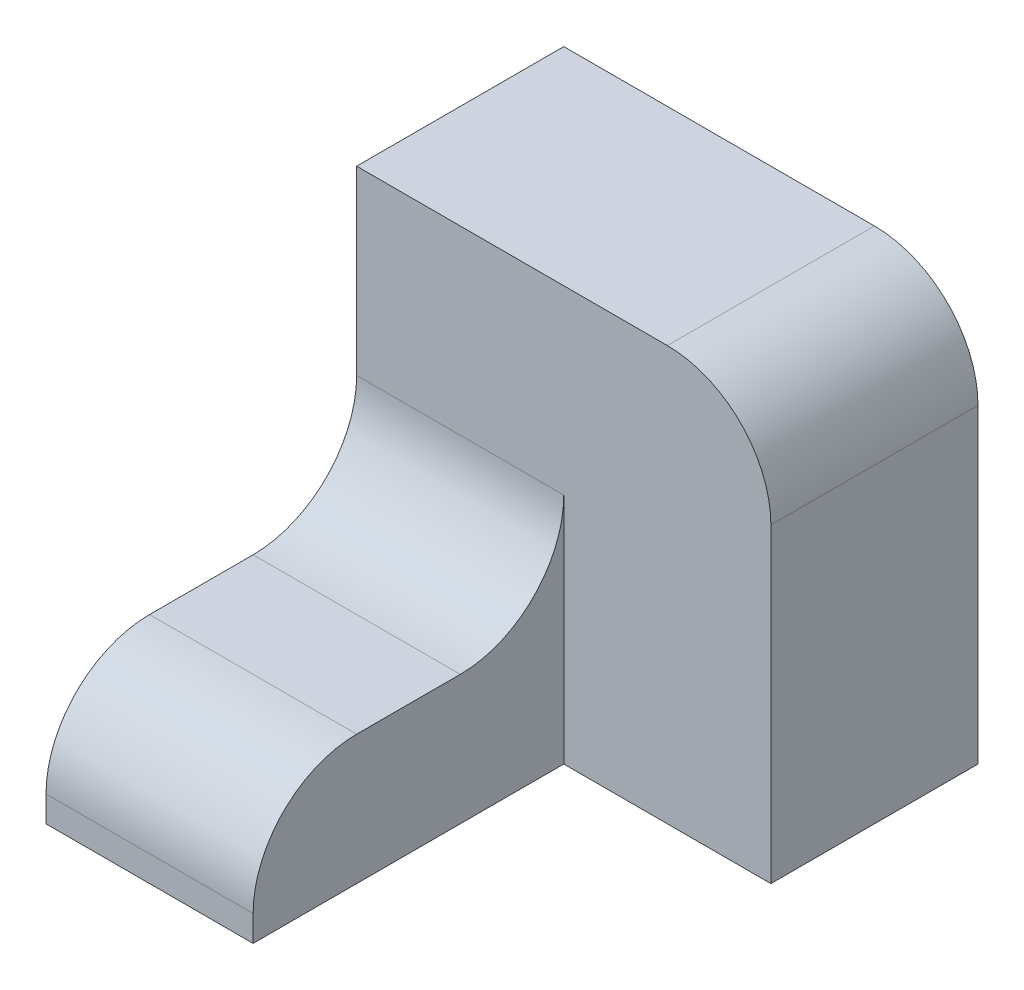
ISO-10303-21;
HEADER;
FILE_DESCRIPTION(('STEP AP214'),'2;1');
FILE_NAME('part.step','',(''),(''),'','','');
FILE_SCHEMA(('AUTOMOTIVE_DESIGN { 1 0 10303 214 1 1 1 1 }'));
ENDSEC;
DATA;
#1=APPLICATION_CONTEXT('core data for automotive mechanical design processes');
#2=APPLICATION_PROTOCOL_DEFINITION('international standard','automotive_design',2000,#1);
#3=PRODUCT_CONTEXT('',#1,'mechanical');
#4=PRODUCT('Part','Part','',(#3));
#5=PRODUCT_RELATED_PRODUCT_CATEGORY('part','',(#4));
#6=PRODUCT_DEFINITION_FORMATION('','',#4);
#7=PRODUCT_DEFINITION_CONTEXT('part definition',#1,'design');
#8=PRODUCT_DEFINITION('design','',#6,#7);
#9=PRODUCT_DEFINITION_SHAPE('','',#8);
#10=(LENGTH_UNIT() NAMED_UNIT(*) SI_UNIT(.MILLI.,.METRE.));
#11=(NAMED_UNIT(*) PLANE_ANGLE_UNIT() SI_UNIT($,.RADIAN.));
#12=(NAMED_UNIT(*) SI_UNIT($,.STERADIAN.) SOLID_ANGLE_UNIT());
#13=UNCERTAINTY_MEASURE_WITH_UNIT(LENGTH_MEASURE(1.E-05),#10,'distance_accuracy_value','');
#14=(GEOMETRIC_REPRESENTATION_CONTEXT(3) GLOBAL_UNCERTAINTY_ASSIGNED_CONTEXT((#13)) GLOBAL_UNIT_ASSIGNED_CONTEXT((#10,
#11,#12)) REPRESENTATION_CONTEXT('',''));
#15=CARTESIAN_POINT('',(0.,0.,0.));
#16=DIRECTION('',(0.,0.,1.));
#17=DIRECTION('',(1.,0.,0.));
#18=AXIS2_PLACEMENT_3D('',#15,#16,#17);
#19=CARTESIAN_POINT('',(-10.,0.,30.));
#20=DIRECTION('',(0.,-1.,0.));
#21=DIRECTION('',(1.,0.,0.));
#22=AXIS2_PLACEMENT_3D('',#19,#20,#21);
#23=PLANE('',#22);
#24=DIRECTION('',(0.,0.,-1.));
#25=VECTOR('',#24,1.);
#26=CARTESIAN_POINT('',(-10.,0.,30.));
#27=LINE('',#26,#25);
#28=CARTESIAN_POINT('',(-10.,0.,20.));
#29=VERTEX_POINT('',#28);
#30=CARTESIAN_POINT('',(-10.,0.,10.));
#31=VERTEX_POINT('',#30);
#32=EDGE_CURVE('E164',#29,#31,#27,.T.);
#33=ORIENTED_EDGE('',*,*,#32,.T.);
#34=DIRECTION('',(-1.,0.,0.));
#35=VECTOR('',#34,1.);
#36=CARTESIAN_POINT('',(-10.,0.,10.));
#37=LINE('',#36,#35);
#38=CARTESIAN_POINT('',(-30.,0.,10.));
#39=VERTEX_POINT('',#38);
#40=EDGE_CURVE('E178',#31,#39,#37,.T.);
#41=ORIENTED_EDGE('',*,*,#40,.T.);
#42=DIRECTION('',(0.,0.,-1.));
#43=VECTOR('',#42,1.);
#44=CARTESIAN_POINT('',(-30.,0.,30.));
#45=LINE('',#44,#43);
#46=CARTESIAN_POINT('',(-30.,0.,20.));
#47=VERTEX_POINT('',#46);
#48=EDGE_CURVE('E173',#47,#39,#45,.T.);
#49=ORIENTED_EDGE('',*,*,#48,.F.);
#50=DIRECTION('',(-1.,0.,0.));
#51=VECTOR('',#50,1.);
#52=CARTESIAN_POINT('',(-10.,0.,20.));
#53=LINE('',#52,#51);
#54=EDGE_CURVE('E176',#47,#29,#53,.F.);
#55=ORIENTED_EDGE('',*,*,#54,.T.);
#56=EDGE_LOOP('',(#33,#41,#49,#55));
#57=FACE_BOUND('',#56,.T.);
#58=ADVANCED_FACE('F35',(#57),#23,.F.);
#59=CARTESIAN_POINT('',(-30.,0.,30.));
#60=DIRECTION('',(1.,0.,0.));
#61=DIRECTION('',(0.,0.,-1.));
#62=AXIS2_PLACEMENT_3D('',#59,#60,#61);
#63=PLANE('',#62);
#64=DIRECTION('',(0.,-1.,0.));
#65=VECTOR('',#64,1.);
#66=CARTESIAN_POINT('',(-30.,0.,30.));
#67=LINE('',#66,#65);
#68=CARTESIAN_POINT('',(-30.,-10.,30.));
#69=VERTEX_POINT('',#68);
#70=CARTESIAN_POINT('',(-30.,-12.5,30.));
#71=VERTEX_POINT('',#70);
#72=EDGE_CURVE('E158',#69,#71,#67,.T.);
#73=ORIENTED_EDGE('',*,*,#72,.F.);
#74=CARTESIAN_POINT('',(-30.,-10.,20.));
#75=DIRECTION('',(1.,0.,0.));
#76=DIRECTION('',(0.,0.,-1.));
#77=AXIS2_PLACEMENT_3D('',#74,#75,#76);
#78=CIRCLE('',#77,10.);
#79=EDGE_CURVE('E58',#69,#47,#78,.F.);
#80=ORIENTED_EDGE('',*,*,#79,.T.);
#81=ORIENTED_EDGE('',*,*,#48,.T.);
#82=CARTESIAN_POINT('',(-30.,10.,10.));
#83=DIRECTION('',(1.,0.,0.));
#84=DIRECTION('',(0.,0.,-1.));
#85=AXIS2_PLACEMENT_3D('',#82,#83,#84);
#86=CIRCLE('',#85,10.);
#87=CARTESIAN_POINT('',(-30.,10.,0.));
#88=VERTEX_POINT('',#87);
#89=EDGE_CURVE('E43',#39,#88,#86,.T.);
#90=ORIENTED_EDGE('',*,*,#89,.T.);
#91=DIRECTION('',(0.,-1.,0.));
#92=VECTOR('',#91,1.);
#93=CARTESIAN_POINT('',(-30.,27.5,0.));
#94=LINE('',#93,#92);
#95=CARTESIAN_POINT('',(-30.,27.5,0.));
#96=VERTEX_POINT('',#95);
#97=EDGE_CURVE('E134',#96,#88,#94,.T.);
#98=ORIENTED_EDGE('',*,*,#97,.F.);
#99=DIRECTION('',(0.,0.,1.));
#100=VECTOR('',#99,1.);
#101=CARTESIAN_POINT('',(-30.,27.5,-20.));
#102=LINE('',#101,#100);
#103=CARTESIAN_POINT('',(-30.,27.5,-20.));
#104=VERTEX_POINT('',#103);
#105=EDGE_CURVE('E118',#104,#96,#102,.T.);
#106=ORIENTED_EDGE('',*,*,#105,.F.);
#107=DIRECTION('',(0.,-1.,0.));
#108=VECTOR('',#107,1.);
#109=CARTESIAN_POINT('',(-30.,27.5,-20.));
#110=LINE('',#109,#108);
#111=CARTESIAN_POINT('',(-30.,-12.5,-20.));
#112=VERTEX_POINT('',#111);
#113=EDGE_CURVE('E125',#104,#112,#110,.T.);
#114=ORIENTED_EDGE('',*,*,#113,.T.);
#115=DIRECTION('',(0.,0.,-1.));
#116=VECTOR('',#115,1.);
#117=CARTESIAN_POINT('',(-30.,-12.5,30.));
#118=LINE('',#117,#116);
#119=EDGE_CURVE('E171',#71,#112,#118,.T.);
#120=ORIENTED_EDGE('',*,*,#119,.F.);
#121=EDGE_LOOP('',(#73,#80,#81,#90,#98,#106,#114,#120));
#122=FACE_BOUND('',#121,.T.);
#123=ADVANCED_FACE('F131',(#122),#63,.F.);
#124=CARTESIAN_POINT('',(-30.,-12.5,30.));
#125=DIRECTION('',(0.,1.,0.));
#126=DIRECTION('',(0.,0.,1.));
#127=AXIS2_PLACEMENT_3D('',#124,#125,#126);
#128=PLANE('',#127);
#129=ORIENTED_EDGE('',*,*,#119,.T.);
#130=DIRECTION('',(1.,0.,0.));
#131=VECTOR('',#130,1.);
#132=CARTESIAN_POINT('',(-30.,-12.5,-20.));
#133=LINE('',#132,#131);
#134=CARTESIAN_POINT('',(10.,-12.5,-20.));
#135=VERTEX_POINT('',#134);
#136=EDGE_CURVE('E142',#112,#135,#133,.T.);
#137=ORIENTED_EDGE('',*,*,#136,.T.);
#138=DIRECTION('',(0.,0.,1.));
#139=VECTOR('',#138,1.);
#140=CARTESIAN_POINT('',(10.,-12.5,-20.));
#141=LINE('',#140,#139);
#142=CARTESIAN_POINT('',(10.,-12.5,0.));
#143=VERTEX_POINT('',#142);
#144=EDGE_CURVE('E135',#135,#143,#141,.T.);
#145=ORIENTED_EDGE('',*,*,#144,.T.);
#146=DIRECTION('',(1.,0.,0.));
#147=VECTOR('',#146,1.);
#148=CARTESIAN_POINT('',(-30.,-12.5,0.));
#149=LINE('',#148,#147);
#150=CARTESIAN_POINT('',(-10.,-12.5,0.));
#151=VERTEX_POINT('',#150);
#152=EDGE_CURVE('E151',#151,#143,#149,.T.);
#153=ORIENTED_EDGE('',*,*,#152,.F.);
#154=DIRECTION('',(0.,0.,-1.));
#155=VECTOR('',#154,1.);
#156=CARTESIAN_POINT('',(-10.,-12.5,30.));
#157=LINE('',#156,#155);
#158=CARTESIAN_POINT('',(-10.,-12.5,30.));
#159=VERTEX_POINT('',#158);
#160=EDGE_CURVE('E168',#159,#151,#157,.T.);
#161=ORIENTED_EDGE('',*,*,#160,.F.);
#162=DIRECTION('',(1.,0.,0.));
#163=VECTOR('',#162,1.);
#164=CARTESIAN_POINT('',(-30.,-12.5,30.));
#165=LINE('',#164,#163);
#166=EDGE_CURVE('E160',#71,#159,#165,.T.);
#167=ORIENTED_EDGE('',*,*,#166,.F.);
#168=EDGE_LOOP('',(#129,#137,#145,#153,#161,#167));
#169=FACE_BOUND('',#168,.T.);
#170=ADVANCED_FACE('F210',(#169),#128,.F.);
#171=CARTESIAN_POINT('',(-10.,-12.5,30.));
#172=DIRECTION('',(-1.,0.,0.));
#173=DIRECTION('',(0.,0.,1.));
#174=AXIS2_PLACEMENT_3D('',#171,#172,#173);
#175=PLANE('',#174);
#176=ORIENTED_EDGE('',*,*,#32,.F.);
#177=CARTESIAN_POINT('',(-10.,-10.,20.));
#178=DIRECTION('',(-1.,0.,0.));
#179=DIRECTION('',(0.,0.,1.));
#180=AXIS2_PLACEMENT_3D('',#177,#178,#179);
#181=CIRCLE('',#180,10.);
#182=CARTESIAN_POINT('',(-10.,-10.,30.));
#183=VERTEX_POINT('',#182);
#184=EDGE_CURVE('E50',#29,#183,#181,.F.);
#185=ORIENTED_EDGE('',*,*,#184,.T.);
#186=DIRECTION('',(0.,1.,0.));
#187=VECTOR('',#186,1.);
#188=CARTESIAN_POINT('',(-10.,-12.5,30.));
#189=LINE('',#188,#187);
#190=EDGE_CURVE('E162',#159,#183,#189,.T.);
#191=ORIENTED_EDGE('',*,*,#190,.F.);
#192=ORIENTED_EDGE('',*,*,#160,.T.);
#193=DIRECTION('',(0.,1.,0.));
#194=VECTOR('',#193,1.);
#195=CARTESIAN_POINT('',(-10.,-12.5,0.));
#196=LINE('',#195,#194);
#197=CARTESIAN_POINT('',(-10.,10.,0.));
#198=VERTEX_POINT('',#197);
#199=EDGE_CURVE('E156',#151,#198,#196,.T.);
#200=ORIENTED_EDGE('',*,*,#199,.T.);
#201=CARTESIAN_POINT('',(-10.,10.,10.));
#202=DIRECTION('',(-1.,0.,0.));
#203=DIRECTION('',(0.,0.,1.));
#204=AXIS2_PLACEMENT_3D('',#201,#202,#203);
#205=CIRCLE('',#204,10.);
#206=EDGE_CURVE('E11',#198,#31,#205,.T.);
#207=ORIENTED_EDGE('',*,*,#206,.T.);
#208=EDGE_LOOP('',(#176,#185,#191,#192,#200,#207));
#209=FACE_BOUND('',#208,.T.);
#210=ADVANCED_FACE('F203',(#209),#175,.F.);
#211=CARTESIAN_POINT('',(0.,0.,30.));
#212=DIRECTION('',(0.,0.,1.));
#213=DIRECTION('',(1.,0.,0.));
#214=AXIS2_PLACEMENT_3D('',#211,#212,#213);
#215=PLANE('',#214);
#216=ORIENTED_EDGE('',*,*,#190,.T.);
#217=DIRECTION('',(-1.,0.,0.));
#218=VECTOR('',#217,1.);
#219=CARTESIAN_POINT('',(-30.,-10.,30.));
#220=LINE('',#219,#218);
#221=EDGE_CURVE('E192',#183,#69,#220,.T.);
#222=ORIENTED_EDGE('',*,*,#221,.T.);
#223=ORIENTED_EDGE('',*,*,#72,.T.);
#224=ORIENTED_EDGE('',*,*,#166,.T.);
#225=EDGE_LOOP('',(#216,#222,#223,#224));
#226=FACE_BOUND('',#225,.T.);
#227=ADVANCED_FACE('F206',(#226),#215,.T.);
#228=CARTESIAN_POINT('',(0.,0.,0.));
#229=DIRECTION('',(0.,0.,1.));
#230=DIRECTION('',(1.,0.,0.));
#231=AXIS2_PLACEMENT_3D('',#228,#229,#230);
#232=PLANE('',#231);
#233=ORIENTED_EDGE('',*,*,#97,.T.);
#234=DIRECTION('',(-1.,0.,0.));
#235=VECTOR('',#234,1.);
#236=CARTESIAN_POINT('',(0.,10.,0.));
#237=LINE('',#236,#235);
#238=EDGE_CURVE('E183',#88,#198,#237,.F.);
#239=ORIENTED_EDGE('',*,*,#238,.T.);
#240=ORIENTED_EDGE('',*,*,#199,.F.);
#241=ORIENTED_EDGE('',*,*,#152,.T.);
#242=DIRECTION('',(0.,1.,0.));
#243=VECTOR('',#242,1.);
#244=CARTESIAN_POINT('',(10.,-12.5,0.));
#245=LINE('',#244,#243);
#246=CARTESIAN_POINT('',(10.,17.5,0.));
#247=VERTEX_POINT('',#246);
#248=EDGE_CURVE('E126',#143,#247,#245,.T.);
#249=ORIENTED_EDGE('',*,*,#248,.T.);
#250=CARTESIAN_POINT('',(0.,17.5,0.));
#251=DIRECTION('',(0.,0.,1.));
#252=DIRECTION('',(1.,0.,0.));
#253=AXIS2_PLACEMENT_3D('',#250,#251,#252);
#254=CIRCLE('',#253,10.);
#255=CARTESIAN_POINT('',(0.,27.5,0.));
#256=VERTEX_POINT('',#255);
#257=EDGE_CURVE('E181',#247,#256,#254,.T.);
#258=ORIENTED_EDGE('',*,*,#257,.T.);
#259=DIRECTION('',(-1.,0.,0.));
#260=VECTOR('',#259,1.);
#261=CARTESIAN_POINT('',(10.,27.5,0.));
#262=LINE('',#261,#260);
#263=EDGE_CURVE('E148',#256,#96,#262,.T.);
#264=ORIENTED_EDGE('',*,*,#263,.T.);
#265=EDGE_LOOP('',(#233,#239,#240,#241,#249,#258,#264));
#266=FACE_BOUND('',#265,.T.);
#267=ADVANCED_FACE('F200',(#266),#232,.T.);
#268=CARTESIAN_POINT('',(10.,27.5,-20.));
#269=DIRECTION('',(0.,1.,0.));
#270=DIRECTION('',(-1.,0.,0.));
#271=AXIS2_PLACEMENT_3D('',#268,#269,#270);
#272=PLANE('',#271);
#273=ORIENTED_EDGE('',*,*,#263,.F.);
#274=DIRECTION('',(0.,0.,1.));
#275=VECTOR('',#274,1.);
#276=CARTESIAN_POINT('',(0.,27.5,-20.));
#277=LINE('',#276,#275);
#278=CARTESIAN_POINT('',(0.,27.5,-20.));
#279=VERTEX_POINT('',#278);
#280=EDGE_CURVE('E121',#256,#279,#277,.F.);
#281=ORIENTED_EDGE('',*,*,#280,.T.);
#282=DIRECTION('',(-1.,0.,0.));
#283=VECTOR('',#282,1.);
#284=CARTESIAN_POINT('',(10.,27.5,-20.));
#285=LINE('',#284,#283);
#286=EDGE_CURVE('E114',#279,#104,#285,.T.);
#287=ORIENTED_EDGE('',*,*,#286,.T.);
#288=ORIENTED_EDGE('',*,*,#105,.T.);
#289=EDGE_LOOP('',(#273,#281,#287,#288));
#290=FACE_BOUND('',#289,.T.);
#291=ADVANCED_FACE('F117',(#290),#272,.T.);
#292=CARTESIAN_POINT('',(10.,-12.5,-20.));
#293=DIRECTION('',(1.,0.,0.));
#294=DIRECTION('',(0.,0.,-1.));
#295=AXIS2_PLACEMENT_3D('',#292,#293,#294);
#296=PLANE('',#295);
#297=DIRECTION('',(0.,1.,0.));
#298=VECTOR('',#297,1.);
#299=CARTESIAN_POINT('',(10.,-12.5,-20.));
#300=LINE('',#299,#298);
#301=CARTESIAN_POINT('',(10.,17.5,-20.));
#302=VERTEX_POINT('',#301);
#303=EDGE_CURVE('E136',#135,#302,#300,.T.);
#304=ORIENTED_EDGE('',*,*,#303,.T.);
#305=DIRECTION('',(0.,0.,1.));
#306=VECTOR('',#305,1.);
#307=CARTESIAN_POINT('',(10.,17.5,-20.));
#308=LINE('',#307,#306);
#309=EDGE_CURVE('E186',#302,#247,#308,.T.);
#310=ORIENTED_EDGE('',*,*,#309,.T.);
#311=ORIENTED_EDGE('',*,*,#248,.F.);
#312=ORIENTED_EDGE('',*,*,#144,.F.);
#313=EDGE_LOOP('',(#304,#310,#311,#312));
#314=FACE_BOUND('',#313,.T.);
#315=ADVANCED_FACE('F214',(#314),#296,.T.);
#316=CARTESIAN_POINT('',(0.,0.,-20.));
#317=DIRECTION('',(0.,0.,1.));
#318=DIRECTION('',(1.,0.,0.));
#319=AXIS2_PLACEMENT_3D('',#316,#317,#318);
#320=PLANE('',#319);
#321=ORIENTED_EDGE('',*,*,#286,.F.);
#322=CARTESIAN_POINT('',(0.,17.5,-20.));
#323=DIRECTION('',(0.,0.,1.));
#324=DIRECTION('',(1.,0.,0.));
#325=AXIS2_PLACEMENT_3D('',#322,#323,#324);
#326=CIRCLE('',#325,10.);
#327=EDGE_CURVE('E190',#279,#302,#326,.F.);
#328=ORIENTED_EDGE('',*,*,#327,.T.);
#329=ORIENTED_EDGE('',*,*,#303,.F.);
#330=ORIENTED_EDGE('',*,*,#136,.F.);
#331=ORIENTED_EDGE('',*,*,#113,.F.);
#332=EDGE_LOOP('',(#321,#328,#329,#330,#331));
#333=FACE_BOUND('',#332,.T.);
#334=ADVANCED_FACE('F139',(#333),#320,.F.);
#335=CARTESIAN_POINT('',(-10.,10.,10.));
#336=DIRECTION('',(-1.,0.,0.));
#337=DIRECTION('',(0.,-1.,0.));
#338=AXIS2_PLACEMENT_3D('',#335,#336,#337);
#339=CYLINDRICAL_SURFACE('',#338,10.);
#340=ORIENTED_EDGE('',*,*,#206,.F.);
#341=ORIENTED_EDGE('',*,*,#238,.F.);
#342=ORIENTED_EDGE('',*,*,#89,.F.);
#343=ORIENTED_EDGE('',*,*,#40,.F.);
#344=EDGE_LOOP('',(#340,#341,#342,#343));
#345=FACE_BOUND('',#344,.T.);
#346=ADVANCED_FACE('F202',(#345),#339,.F.);
#347=CARTESIAN_POINT('',(0.,17.5,-20.));
#348=DIRECTION('',(0.,0.,1.));
#349=DIRECTION('',(1.,0.,0.));
#350=AXIS2_PLACEMENT_3D('',#347,#348,#349);
#351=CYLINDRICAL_SURFACE('',#350,10.);
#352=ORIENTED_EDGE('',*,*,#327,.F.);
#353=ORIENTED_EDGE('',*,*,#280,.F.);
#354=ORIENTED_EDGE('',*,*,#257,.F.);
#355=ORIENTED_EDGE('',*,*,#309,.F.);
#356=EDGE_LOOP('',(#352,#353,#354,#355));
#357=FACE_BOUND('',#356,.T.);
#358=ADVANCED_FACE('F217',(#357),#351,.T.);
#359=CARTESIAN_POINT('',(0.,-10.,20.));
#360=DIRECTION('',(1.,0.,0.));
#361=DIRECTION('',(0.,1.,0.));
#362=AXIS2_PLACEMENT_3D('',#359,#360,#361);
#363=CYLINDRICAL_SURFACE('',#362,10.);
#364=ORIENTED_EDGE('',*,*,#184,.F.);
#365=ORIENTED_EDGE('',*,*,#54,.F.);
#366=ORIENTED_EDGE('',*,*,#79,.F.);
#367=ORIENTED_EDGE('',*,*,#221,.F.);
#368=EDGE_LOOP('',(#364,#365,#366,#367));
#369=FACE_BOUND('',#368,.T.);
#370=ADVANCED_FACE('F37',(#369),#363,.T.);
#371=CLOSED_SHELL('',(#58,#123,#170,#210,#227,#267,#291,#315,#334,#346,#358,#370));
#372=MANIFOLD_SOLID_BREP('B2',#371);
#373=ADVANCED_BREP_SHAPE_REPRESENTATION('',(#18,#372),#14);
#374=SHAPE_DEFINITION_REPRESENTATION(#9,#373);
ENDSEC;
END-ISO-10303-21;
